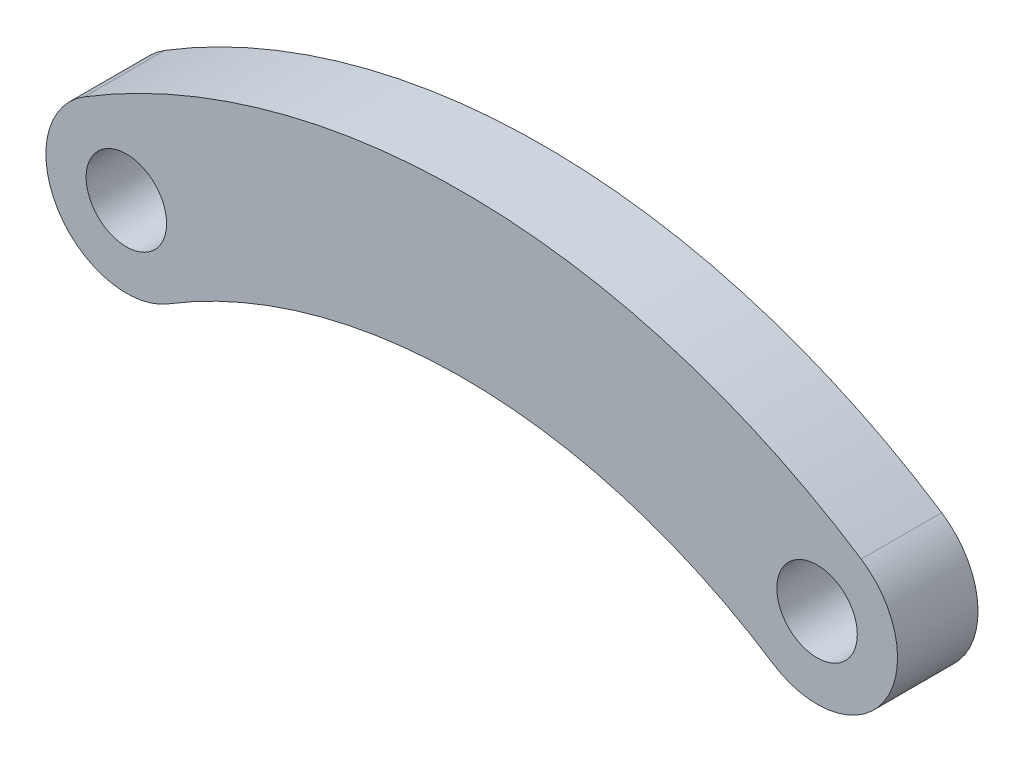
ISO-10303-21;
HEADER;
FILE_DESCRIPTION(('STEP AP214'),'2;1');
FILE_NAME('part.step','',(''),(''),'','','');
FILE_SCHEMA(('AUTOMOTIVE_DESIGN { 1 0 10303 214 1 1 1 1 }'));
ENDSEC;
DATA;
#1=APPLICATION_CONTEXT('core data for automotive mechanical design processes');
#2=APPLICATION_PROTOCOL_DEFINITION('international standard','automotive_design',2000,#1);
#3=PRODUCT_CONTEXT('',#1,'mechanical');
#4=PRODUCT('Part','Part','',(#3));
#5=PRODUCT_RELATED_PRODUCT_CATEGORY('part','',(#4));
#6=PRODUCT_DEFINITION_FORMATION('','',#4);
#7=PRODUCT_DEFINITION_CONTEXT('part definition',#1,'design');
#8=PRODUCT_DEFINITION('design','',#6,#7);
#9=PRODUCT_DEFINITION_SHAPE('','',#8);
#10=(LENGTH_UNIT() NAMED_UNIT(*) SI_UNIT(.MILLI.,.METRE.));
#11=(NAMED_UNIT(*) PLANE_ANGLE_UNIT() SI_UNIT($,.RADIAN.));
#12=(NAMED_UNIT(*) SI_UNIT($,.STERADIAN.) SOLID_ANGLE_UNIT());
#13=UNCERTAINTY_MEASURE_WITH_UNIT(LENGTH_MEASURE(1.E-05),#10,'distance_accuracy_value','');
#14=(GEOMETRIC_REPRESENTATION_CONTEXT(3) GLOBAL_UNCERTAINTY_ASSIGNED_CONTEXT((#13)) GLOBAL_UNIT_ASSIGNED_CONTEXT((#10,
#11,#12)) REPRESENTATION_CONTEXT('',''));
#15=CARTESIAN_POINT('',(0.,0.,0.));
#16=DIRECTION('',(0.,0.,1.));
#17=DIRECTION('',(1.,0.,0.));
#18=AXIS2_PLACEMENT_3D('',#15,#16,#17);
#19=CARTESIAN_POINT('',(8.42975006028058,-9.46112051223595,3.));
#20=DIRECTION('',(0.,0.,1.));
#21=DIRECTION('',(1.,0.,0.));
#22=AXIS2_PLACEMENT_3D('',#19,#20,#21);
#23=PLANE('',#22);
#24=CARTESIAN_POINT('',(-10.7230216208647,0.978784154642668,3.));
#25=DIRECTION('',(0.,0.,1.));
#26=DIRECTION('',(1.,0.,0.));
#27=AXIS2_PLACEMENT_3D('',#24,#25,#26);
#28=CIRCLE('',#27,1.5);
#29=CARTESIAN_POINT('',(-9.22302162086467,0.978784154642668,3.));
#30=VERTEX_POINT('',#29);
#31=EDGE_CURVE('E112',#30,#30,#28,.T.);
#32=ORIENTED_EDGE('',*,*,#31,.F.);
#33=EDGE_LOOP('',(#32));
#34=FACE_BOUND('',#33,.T.);
#35=CARTESIAN_POINT('',(15.0213800161225,0.584061224791557,3.));
#36=DIRECTION('',(0.,0.,1.));
#37=DIRECTION('',(1.,0.,0.));
#38=AXIS2_PLACEMENT_3D('',#35,#36,#37);
#39=CIRCLE('',#38,3.);
#40=CARTESIAN_POINT('',(13.3755015453305,-1.92414212808541,3.));
#41=VERTEX_POINT('',#40);
#42=CARTESIAN_POINT('',(16.6672584869146,3.09226457766852,3.));
#43=VERTEX_POINT('',#42);
#44=EDGE_CURVE('E92',#41,#43,#39,.T.);
#45=ORIENTED_EDGE('',*,*,#44,.T.);
#46=CARTESIAN_POINT('',(1.83812010443863,-19.5063022492634,3.));
#47=DIRECTION('',(0.,0.,1.));
#48=DIRECTION('',(1.,0.,0.));
#49=AXIS2_PLACEMENT_3D('',#46,#47,#48);
#50=CIRCLE('',#49,27.029586896546);
#51=CARTESIAN_POINT('',(-12.2912310677498,3.53626712246481,3.));
#52=VERTEX_POINT('',#51);
#53=EDGE_CURVE('E87',#43,#52,#50,.T.);
#54=ORIENTED_EDGE('',*,*,#53,.T.);
#55=CARTESIAN_POINT('',(-10.7230216208647,0.978784154642668,3.));
#56=DIRECTION('',(0.,0.,1.));
#57=DIRECTION('',(1.,0.,0.));
#58=AXIS2_PLACEMENT_3D('',#55,#56,#57);
#59=CIRCLE('',#58,3.);
#60=CARTESIAN_POINT('',(-9.15481217397956,-1.57869881317947,3.));
#61=VERTEX_POINT('',#60);
#62=EDGE_CURVE('E90',#52,#61,#59,.T.);
#63=ORIENTED_EDGE('',*,*,#62,.T.);
#64=CARTESIAN_POINT('',(1.83812010443863,-19.5063022492634,3.));
#65=DIRECTION('',(0.,0.,-1.));
#66=DIRECTION('',(1.,0.,0.));
#67=AXIS2_PLACEMENT_3D('',#64,#65,#66);
#68=CIRCLE('',#67,21.029586896546);
#69=EDGE_CURVE('E57',#61,#41,#68,.T.);
#70=ORIENTED_EDGE('',*,*,#69,.T.);
#71=EDGE_LOOP('',(#45,#54,#63,#70));
#72=FACE_BOUND('',#71,.T.);
#73=CARTESIAN_POINT('',(15.0213800161225,0.584061224791557,3.));
#74=DIRECTION('',(0.,0.,1.));
#75=DIRECTION('',(1.,0.,0.));
#76=AXIS2_PLACEMENT_3D('',#73,#74,#75);
#77=CIRCLE('',#76,1.5);
#78=CARTESIAN_POINT('',(16.5213800161225,0.584061224791557,3.));
#79=VERTEX_POINT('',#78);
#80=EDGE_CURVE('E134',#79,#79,#77,.T.);
#81=ORIENTED_EDGE('',*,*,#80,.F.);
#82=EDGE_LOOP('',(#81));
#83=FACE_BOUND('',#82,.T.);
#84=ADVANCED_FACE('F39',(#34,#72,#83),#23,.T.);
#85=CARTESIAN_POINT('',(8.42975006028058,-9.46112051223595,0.));
#86=DIRECTION('',(0.,0.,1.));
#87=DIRECTION('',(1.,0.,0.));
#88=AXIS2_PLACEMENT_3D('',#85,#86,#87);
#89=PLANE('',#88);
#90=CARTESIAN_POINT('',(15.0213800161225,0.584061224791557,0.));
#91=DIRECTION('',(0.,0.,1.));
#92=DIRECTION('',(1.,0.,0.));
#93=AXIS2_PLACEMENT_3D('',#90,#91,#92);
#94=CIRCLE('',#93,3.);
#95=CARTESIAN_POINT('',(13.3755015453305,-1.92414212808541,0.));
#96=VERTEX_POINT('',#95);
#97=CARTESIAN_POINT('',(16.6672584869146,3.09226457766852,0.));
#98=VERTEX_POINT('',#97);
#99=EDGE_CURVE('E108',#96,#98,#94,.T.);
#100=ORIENTED_EDGE('',*,*,#99,.F.);
#101=CARTESIAN_POINT('',(1.83812010443863,-19.5063022492634,0.));
#102=DIRECTION('',(0.,0.,-1.));
#103=DIRECTION('',(1.,0.,0.));
#104=AXIS2_PLACEMENT_3D('',#101,#102,#103);
#105=CIRCLE('',#104,21.029586896546);
#106=CARTESIAN_POINT('',(-9.15481217397956,-1.57869881317947,0.));
#107=VERTEX_POINT('',#106);
#108=EDGE_CURVE('E80',#107,#96,#105,.T.);
#109=ORIENTED_EDGE('',*,*,#108,.F.);
#110=CARTESIAN_POINT('',(-10.7230216208647,0.978784154642668,0.));
#111=DIRECTION('',(0.,0.,1.));
#112=DIRECTION('',(1.,0.,0.));
#113=AXIS2_PLACEMENT_3D('',#110,#111,#112);
#114=CIRCLE('',#113,3.);
#115=CARTESIAN_POINT('',(-12.2912310677498,3.53626712246481,0.));
#116=VERTEX_POINT('',#115);
#117=EDGE_CURVE('E74',#116,#107,#114,.T.);
#118=ORIENTED_EDGE('',*,*,#117,.F.);
#119=CARTESIAN_POINT('',(1.83812010443863,-19.5063022492634,0.));
#120=DIRECTION('',(0.,0.,1.));
#121=DIRECTION('',(1.,0.,0.));
#122=AXIS2_PLACEMENT_3D('',#119,#120,#121);
#123=CIRCLE('',#122,27.029586896546);
#124=EDGE_CURVE('E97',#98,#116,#123,.T.);
#125=ORIENTED_EDGE('',*,*,#124,.F.);
#126=EDGE_LOOP('',(#100,#109,#118,#125));
#127=FACE_BOUND('',#126,.T.);
#128=CARTESIAN_POINT('',(-10.7230216208647,0.978784154642668,0.));
#129=DIRECTION('',(0.,0.,1.));
#130=DIRECTION('',(1.,0.,0.));
#131=AXIS2_PLACEMENT_3D('',#128,#129,#130);
#132=CIRCLE('',#131,1.5);
#133=CARTESIAN_POINT('',(-9.22302162086467,0.978784154642668,0.));
#134=VERTEX_POINT('',#133);
#135=EDGE_CURVE('E130',#134,#134,#132,.T.);
#136=ORIENTED_EDGE('',*,*,#135,.T.);
#137=EDGE_LOOP('',(#136));
#138=FACE_BOUND('',#137,.T.);
#139=CARTESIAN_POINT('',(15.0213800161225,0.584061224791557,0.));
#140=DIRECTION('',(0.,0.,1.));
#141=DIRECTION('',(1.,0.,0.));
#142=AXIS2_PLACEMENT_3D('',#139,#140,#141);
#143=CIRCLE('',#142,1.5);
#144=CARTESIAN_POINT('',(16.5213800161225,0.584061224791557,0.));
#145=VERTEX_POINT('',#144);
#146=EDGE_CURVE('E138',#145,#145,#143,.T.);
#147=ORIENTED_EDGE('',*,*,#146,.T.);
#148=EDGE_LOOP('',(#147));
#149=FACE_BOUND('',#148,.T.);
#150=ADVANCED_FACE('F125',(#127,#138,#149),#89,.F.);
#151=CARTESIAN_POINT('',(15.0213800161225,0.584061224791557,3.));
#152=DIRECTION('',(0.,0.,-1.));
#153=DIRECTION('',(-1.,0.,0.));
#154=AXIS2_PLACEMENT_3D('',#151,#152,#153);
#155=CYLINDRICAL_SURFACE('',#154,3.);
#156=ORIENTED_EDGE('',*,*,#99,.T.);
#157=DIRECTION('',(0.,0.,-1.));
#158=VECTOR('',#157,1.);
#159=CARTESIAN_POINT('',(16.6672584869146,3.09226457766852,3.));
#160=LINE('',#159,#158);
#161=EDGE_CURVE('E11',#43,#98,#160,.T.);
#162=ORIENTED_EDGE('',*,*,#161,.F.);
#163=ORIENTED_EDGE('',*,*,#44,.F.);
#164=DIRECTION('',(0.,0.,-1.));
#165=VECTOR('',#164,1.);
#166=CARTESIAN_POINT('',(13.3755015453305,-1.92414212808541,3.));
#167=LINE('',#166,#165);
#168=EDGE_CURVE('E104',#41,#96,#167,.T.);
#169=ORIENTED_EDGE('',*,*,#168,.T.);
#170=EDGE_LOOP('',(#156,#162,#163,#169));
#171=FACE_BOUND('',#170,.T.);
#172=ADVANCED_FACE('F41',(#171),#155,.T.);
#173=CARTESIAN_POINT('',(1.83812010443863,-19.5063022492634,3.));
#174=DIRECTION('',(0.,0.,-1.));
#175=DIRECTION('',(-1.,0.,0.));
#176=AXIS2_PLACEMENT_3D('',#173,#174,#175);
#177=CYLINDRICAL_SURFACE('',#176,27.029586896546);
#178=ORIENTED_EDGE('',*,*,#124,.T.);
#179=DIRECTION('',(0.,0.,-1.));
#180=VECTOR('',#179,1.);
#181=CARTESIAN_POINT('',(-12.2912310677498,3.53626712246481,3.));
#182=LINE('',#181,#180);
#183=EDGE_CURVE('E49',#52,#116,#182,.T.);
#184=ORIENTED_EDGE('',*,*,#183,.F.);
#185=ORIENTED_EDGE('',*,*,#53,.F.);
#186=ORIENTED_EDGE('',*,*,#161,.T.);
#187=EDGE_LOOP('',(#178,#184,#185,#186));
#188=FACE_BOUND('',#187,.T.);
#189=ADVANCED_FACE('F96',(#188),#177,.T.);
#190=CARTESIAN_POINT('',(-10.7230216208647,0.978784154642668,3.));
#191=DIRECTION('',(0.,0.,-1.));
#192=DIRECTION('',(-1.,0.,0.));
#193=AXIS2_PLACEMENT_3D('',#190,#191,#192);
#194=CYLINDRICAL_SURFACE('',#193,3.);
#195=ORIENTED_EDGE('',*,*,#117,.T.);
#196=DIRECTION('',(0.,0.,-1.));
#197=VECTOR('',#196,1.);
#198=CARTESIAN_POINT('',(-9.15481217397956,-1.57869881317947,3.));
#199=LINE('',#198,#197);
#200=EDGE_CURVE('E99',#61,#107,#199,.T.);
#201=ORIENTED_EDGE('',*,*,#200,.F.);
#202=ORIENTED_EDGE('',*,*,#62,.F.);
#203=ORIENTED_EDGE('',*,*,#183,.T.);
#204=EDGE_LOOP('',(#195,#201,#202,#203));
#205=FACE_BOUND('',#204,.T.);
#206=ADVANCED_FACE('F100',(#205),#194,.T.);
#207=CARTESIAN_POINT('',(1.83812010443863,-19.5063022492634,3.));
#208=DIRECTION('',(0.,0.,-1.));
#209=DIRECTION('',(-1.,0.,0.));
#210=AXIS2_PLACEMENT_3D('',#207,#208,#209);
#211=CYLINDRICAL_SURFACE('',#210,21.029586896546);
#212=ORIENTED_EDGE('',*,*,#108,.T.);
#213=ORIENTED_EDGE('',*,*,#168,.F.);
#214=ORIENTED_EDGE('',*,*,#69,.F.);
#215=ORIENTED_EDGE('',*,*,#200,.T.);
#216=EDGE_LOOP('',(#212,#213,#214,#215));
#217=FACE_BOUND('',#216,.T.);
#218=ADVANCED_FACE('F122',(#217),#211,.F.);
#219=CARTESIAN_POINT('',(-10.7230216208647,0.978784154642668,3.));
#220=DIRECTION('',(0.,0.,-1.));
#221=DIRECTION('',(-1.,0.,0.));
#222=AXIS2_PLACEMENT_3D('',#219,#220,#221);
#223=CYLINDRICAL_SURFACE('',#222,1.5);
#224=ORIENTED_EDGE('',*,*,#31,.T.);
#225=EDGE_LOOP('',(#224));
#226=FACE_BOUND('',#225,.T.);
#227=ORIENTED_EDGE('',*,*,#135,.F.);
#228=EDGE_LOOP('',(#227));
#229=FACE_BOUND('',#228,.T.);
#230=ADVANCED_FACE('F157',(#226,#229),#223,.F.);
#231=CARTESIAN_POINT('',(15.0213800161225,0.584061224791557,3.));
#232=DIRECTION('',(0.,0.,-1.));
#233=DIRECTION('',(-1.,0.,0.));
#234=AXIS2_PLACEMENT_3D('',#231,#232,#233);
#235=CYLINDRICAL_SURFACE('',#234,1.5);
#236=ORIENTED_EDGE('',*,*,#80,.T.);
#237=EDGE_LOOP('',(#236));
#238=FACE_BOUND('',#237,.T.);
#239=ORIENTED_EDGE('',*,*,#146,.F.);
#240=EDGE_LOOP('',(#239));
#241=FACE_BOUND('',#240,.T.);
#242=ADVANCED_FACE('F146',(#238,#241),#235,.F.);
#243=CLOSED_SHELL('',(#84,#150,#172,#189,#206,#218,#230,#242));
#244=MANIFOLD_SOLID_BREP('B2',#243);
#245=ADVANCED_BREP_SHAPE_REPRESENTATION('',(#18,#244),#14);
#246=SHAPE_DEFINITION_REPRESENTATION(#9,#245);
ENDSEC;
END-ISO-10303-21;
